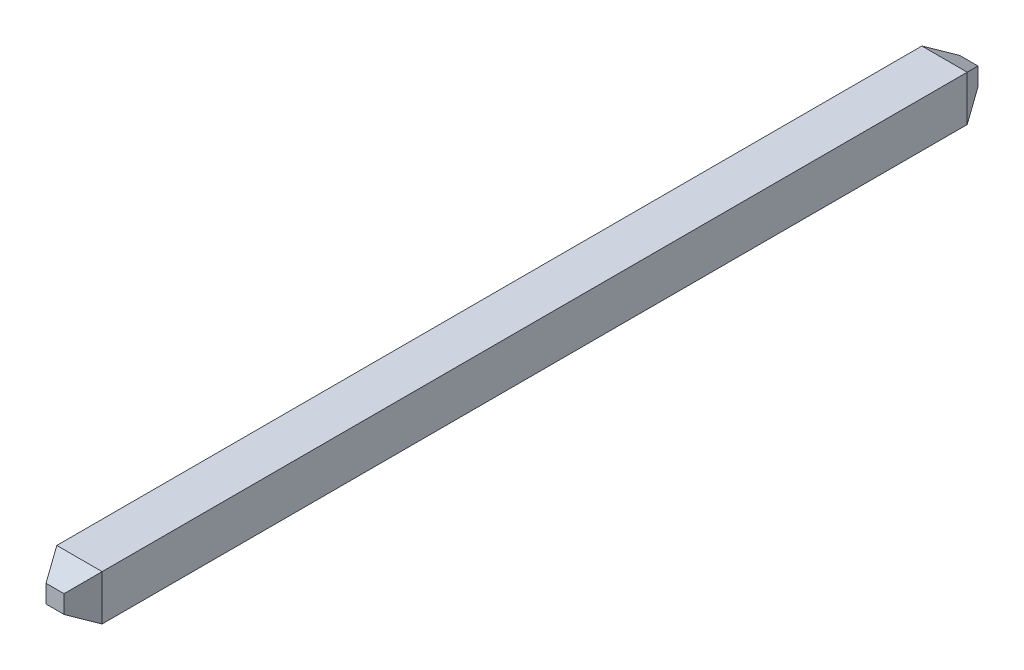
ISO-10303-21;
HEADER;
FILE_DESCRIPTION(('STEP AP214'),'2;1');
FILE_NAME('part.step','',(''),(''),'','','');
FILE_SCHEMA(('AUTOMOTIVE_DESIGN { 1 0 10303 214 1 1 1 1 }'));
ENDSEC;
DATA;
#1=APPLICATION_CONTEXT('core data for automotive mechanical design processes');
#2=APPLICATION_PROTOCOL_DEFINITION('international standard','automotive_design',2000,#1);
#3=PRODUCT_CONTEXT('',#1,'mechanical');
#4=PRODUCT('Part','Part','',(#3));
#5=PRODUCT_RELATED_PRODUCT_CATEGORY('part','',(#4));
#6=PRODUCT_DEFINITION_FORMATION('','',#4);
#7=PRODUCT_DEFINITION_CONTEXT('part definition',#1,'design');
#8=PRODUCT_DEFINITION('design','',#6,#7);
#9=PRODUCT_DEFINITION_SHAPE('','',#8);
#10=(LENGTH_UNIT() NAMED_UNIT(*) SI_UNIT(.MILLI.,.METRE.));
#11=(NAMED_UNIT(*) PLANE_ANGLE_UNIT() SI_UNIT($,.RADIAN.));
#12=(NAMED_UNIT(*) SI_UNIT($,.STERADIAN.) SOLID_ANGLE_UNIT());
#13=UNCERTAINTY_MEASURE_WITH_UNIT(LENGTH_MEASURE(1.E-05),#10,'distance_accuracy_value','');
#14=(GEOMETRIC_REPRESENTATION_CONTEXT(3) GLOBAL_UNCERTAINTY_ASSIGNED_CONTEXT((#13)) GLOBAL_UNIT_ASSIGNED_CONTEXT((#10,
#11,#12)) REPRESENTATION_CONTEXT('',''));
#15=CARTESIAN_POINT('',(0.,0.,0.));
#16=DIRECTION('',(0.,0.,1.));
#17=DIRECTION('',(1.,0.,0.));
#18=AXIS2_PLACEMENT_3D('',#15,#16,#17);
#19=CARTESIAN_POINT('',(2.66011510041924,0.945,-3.20872569516347));
#20=DIRECTION('',(0.872569516347454,0.,-0.488489958076081));
#21=DIRECTION('',(-0.488489958076081,0.,-0.872569516347454));
#22=AXIS2_PLACEMENT_3D('',#19,#20,#21);
#23=PLANE('',#22);
#24=DIRECTION('',(0.,1.,0.));
#25=VECTOR('',#24,1.);
#26=CARTESIAN_POINT('',(2.85534185664468,0.944999999999999,-2.86000017186176));
#27=LINE('',#26,#25);
#28=CARTESIAN_POINT('',(2.85534185663262,0.954999975315067,-2.85999984563027));
#29=VERTEX_POINT('',#28);
#30=CARTESIAN_POINT('',(2.85534201729186,1.58500016035866,-2.8599998849043));
#31=VERTEX_POINT('',#30);
#32=EDGE_CURVE('E118',#29,#31,#27,.T.);
#33=ORIENTED_EDGE('',*,*,#32,.F.);
#34=DIRECTION('',(0.439072617568647,-0.438284036988111,0.784297353956279));
#35=VECTOR('',#34,1.);
#36=CARTESIAN_POINT('',(2.665,1.145,-3.2));
#37=LINE('',#36,#35);
#38=CARTESIAN_POINT('',(2.665,1.145,-3.2));
#39=VERTEX_POINT('',#38);
#40=EDGE_CURVE('E116',#39,#29,#37,.T.);
#41=ORIENTED_EDGE('',*,*,#40,.F.);
#42=DIRECTION('',(0.,1.,0.));
#43=VECTOR('',#42,1.);
#44=CARTESIAN_POINT('',(2.665,1.135,-3.2));
#45=LINE('',#44,#43);
#46=CARTESIAN_POINT('',(2.665,1.395,-3.2));
#47=VERTEX_POINT('',#46);
#48=EDGE_CURVE('E79',#47,#39,#45,.F.);
#49=ORIENTED_EDGE('',*,*,#48,.F.);
#50=DIRECTION('',(-0.439072617568647,-0.438284036988111,-0.784297353956279));
#51=VECTOR('',#50,1.);
#52=CARTESIAN_POINT('',(2.85534185664468,1.585,-2.86000017186176));
#53=LINE('',#52,#51);
#54=EDGE_CURVE('E110',#31,#47,#53,.T.);
#55=ORIENTED_EDGE('',*,*,#54,.F.);
#56=EDGE_LOOP('',(#33,#41,#49,#55));
#57=FACE_BOUND('',#56,.T.);
#58=ADVANCED_FACE('F17',(#57),#23,.T.);
#59=CARTESIAN_POINT('',(2.66036702814295,0.945,9.50441734607014));
#60=DIRECTION('',(0.873317045523297,0.,0.487152273933376));
#61=DIRECTION('',(0.487152273933376,0.,-0.873317045523297));
#62=AXIS2_PLACEMENT_3D('',#59,#60,#61);
#63=PLANE('',#62);
#64=DIRECTION('',(-0.437799852400894,0.438586917260846,0.784839349959839));
#65=VECTOR('',#64,1.);
#66=CARTESIAN_POINT('',(2.85489789955164,0.954999686828527,9.15568378706484));
#67=LINE('',#66,#65);
#68=CARTESIAN_POINT('',(2.85489765454992,0.954999891076848,9.15568368845103));
#69=VERTEX_POINT('',#68);
#70=CARTESIAN_POINT('',(2.66523855088228,1.145,9.49568417561491));
#71=VERTEX_POINT('',#70);
#72=EDGE_CURVE('E122',#69,#71,#67,.T.);
#73=ORIENTED_EDGE('',*,*,#72,.F.);
#74=DIRECTION('',(0.,1.,0.));
#75=VECTOR('',#74,1.);
#76=CARTESIAN_POINT('',(2.85489853900642,0.944999999999999,9.155683722437));
#77=LINE('',#76,#75);
#78=CARTESIAN_POINT('',(2.85489765280461,1.5850001770326,9.15568371270386));
#79=VERTEX_POINT('',#78);
#80=EDGE_CURVE('E89',#79,#69,#77,.F.);
#81=ORIENTED_EDGE('',*,*,#80,.F.);
#82=DIRECTION('',(0.437799852400903,0.438586917260844,-0.784839349959835));
#83=VECTOR('',#82,1.);
#84=CARTESIAN_POINT('',(2.66523855088228,1.395,9.49568417561491));
#85=LINE('',#84,#83);
#86=CARTESIAN_POINT('',(2.66523855088228,1.395,9.49568417561491));
#87=VERTEX_POINT('',#86);
#88=EDGE_CURVE('E84',#87,#79,#85,.T.);
#89=ORIENTED_EDGE('',*,*,#88,.F.);
#90=DIRECTION('',(0.,1.,0.));
#91=VECTOR('',#90,1.);
#92=CARTESIAN_POINT('',(2.66523855088228,1.405,9.49568417561491));
#93=LINE('',#92,#91);
#94=EDGE_CURVE('E20',#71,#87,#93,.T.);
#95=ORIENTED_EDGE('',*,*,#94,.F.);
#96=EDGE_LOOP('',(#73,#81,#89,#95));
#97=FACE_BOUND('',#96,.T.);
#98=ADVANCED_FACE('F86',(#97),#63,.T.);
#99=CARTESIAN_POINT('',(2.40523855088228,1.405,9.49568417561491));
#100=DIRECTION('',(0.,0.,1.));
#101=DIRECTION('',(1.,0.,0.));
#102=AXIS2_PLACEMENT_3D('',#99,#100,#101);
#103=PLANE('',#102);
#104=DIRECTION('',(1.,0.,0.));
#105=VECTOR('',#104,1.);
#106=CARTESIAN_POINT('',(2.2148966942376,1.395,9.49568417561491));
#107=LINE('',#106,#105);
#108=CARTESIAN_POINT('',(2.41523855088228,1.395,9.49568417561491));
#109=VERTEX_POINT('',#108);
#110=EDGE_CURVE('E93',#109,#87,#107,.T.);
#111=ORIENTED_EDGE('',*,*,#110,.F.);
#112=DIRECTION('',(0.,1.,0.));
#113=VECTOR('',#112,1.);
#114=CARTESIAN_POINT('',(2.41523855088228,0.945,9.49568417561491));
#115=LINE('',#114,#113);
#116=CARTESIAN_POINT('',(2.41523855088228,1.145,9.49568417561491));
#117=VERTEX_POINT('',#116);
#118=EDGE_CURVE('E129',#117,#109,#115,.T.);
#119=ORIENTED_EDGE('',*,*,#118,.F.);
#120=DIRECTION('',(1.,0.,0.));
#121=VECTOR('',#120,1.);
#122=CARTESIAN_POINT('',(2.2148966942376,1.145,9.49568417561491));
#123=LINE('',#122,#121);
#124=EDGE_CURVE('E98',#71,#117,#123,.F.);
#125=ORIENTED_EDGE('',*,*,#124,.F.);
#126=ORIENTED_EDGE('',*,*,#94,.T.);
#127=EDGE_LOOP('',(#111,#119,#125,#126));
#128=FACE_BOUND('',#127,.T.);
#129=ADVANCED_FACE('F95',(#128),#103,.T.);
#130=CARTESIAN_POINT('',(2.2148966942376,1.39012178454432,9.50441360938624));
#131=DIRECTION('',(0.,0.872943377132664,0.487821545567864));
#132=DIRECTION('',(0.,-0.487821545567864,0.872943377132664));
#133=AXIS2_PLACEMENT_3D('',#130,#131,#132);
#134=PLANE('',#133);
#135=DIRECTION('',(-0.439072459537935,0.438284700441641,-0.78429707167252));
#136=VECTOR('',#135,1.);
#137=CARTESIAN_POINT('',(2.41523855088228,1.395,9.49568417561491));
#138=LINE('',#137,#136);
#139=CARTESIAN_POINT('',(2.2248975037028,1.58500008247257,9.15568447138297));
#140=VERTEX_POINT('',#139);
#141=EDGE_CURVE('E102',#109,#140,#138,.T.);
#142=ORIENTED_EDGE('',*,*,#141,.F.);
#143=ORIENTED_EDGE('',*,*,#110,.T.);
#144=ORIENTED_EDGE('',*,*,#88,.T.);
#145=DIRECTION('',(1.,0.,0.));
#146=VECTOR('',#145,1.);
#147=CARTESIAN_POINT('',(2.54006658937282,1.585,9.15568497320463));
#148=LINE('',#147,#146);
#149=EDGE_CURVE('E131',#140,#79,#148,.T.);
#150=ORIENTED_EDGE('',*,*,#149,.F.);
#151=EDGE_LOOP('',(#142,#143,#144,#150));
#152=FACE_BOUND('',#151,.T.);
#153=ADVANCED_FACE('F100',(#152),#134,.T.);
#154=CARTESIAN_POINT('',(2.405,1.135,-3.2));
#155=DIRECTION('',(0.,0.,-1.));
#156=DIRECTION('',(-1.,0.,0.));
#157=AXIS2_PLACEMENT_3D('',#154,#155,#156);
#158=PLANE('',#157);
#159=ORIENTED_EDGE('',*,*,#48,.T.);
#160=DIRECTION('',(1.,0.,0.));
#161=VECTOR('',#160,1.);
#162=CARTESIAN_POINT('',(2.21534185664468,1.145,-3.2));
#163=LINE('',#162,#161);
#164=CARTESIAN_POINT('',(2.415,1.145,-3.2));
#165=VERTEX_POINT('',#164);
#166=EDGE_CURVE('E113',#165,#39,#163,.T.);
#167=ORIENTED_EDGE('',*,*,#166,.F.);
#168=DIRECTION('',(0.,1.,0.));
#169=VECTOR('',#168,1.);
#170=CARTESIAN_POINT('',(2.415,0.945,-3.2));
#171=LINE('',#170,#169);
#172=CARTESIAN_POINT('',(2.415,1.395,-3.2));
#173=VERTEX_POINT('',#172);
#174=EDGE_CURVE('E140',#173,#165,#171,.F.);
#175=ORIENTED_EDGE('',*,*,#174,.F.);
#176=DIRECTION('',(1.,0.,0.));
#177=VECTOR('',#176,1.);
#178=CARTESIAN_POINT('',(2.21534185664468,1.395,-3.2));
#179=LINE('',#178,#177);
#180=EDGE_CURVE('E105',#47,#173,#179,.F.);
#181=ORIENTED_EDGE('',*,*,#180,.F.);
#182=EDGE_LOOP('',(#159,#167,#175,#181));
#183=FACE_BOUND('',#182,.T.);
#184=ADVANCED_FACE('F184',(#183),#158,.T.);
#185=CARTESIAN_POINT('',(2.21534185664468,1.58987821545568,-2.85127073809043));
#186=DIRECTION('',(0.,0.872943377132663,-0.487821545567865));
#187=DIRECTION('',(0.,0.487821545567865,0.872943377132663));
#188=AXIS2_PLACEMENT_3D('',#185,#186,#187);
#189=PLANE('',#188);
#190=DIRECTION('',(1.,0.,0.));
#191=VECTOR('',#190,1.);
#192=CARTESIAN_POINT('',(2.54006658937282,1.585,-2.86000017186176));
#193=LINE('',#192,#191);
#194=CARTESIAN_POINT('',(2.22534144768619,1.5850007068091,-2.8599984305592));
#195=VERTEX_POINT('',#194);
#196=EDGE_CURVE('E137',#31,#195,#193,.F.);
#197=ORIENTED_EDGE('',*,*,#196,.F.);
#198=ORIENTED_EDGE('',*,*,#54,.T.);
#199=ORIENTED_EDGE('',*,*,#180,.T.);
#200=DIRECTION('',(0.437798396819592,-0.43858642908966,-0.784840434713054));
#201=VECTOR('',#200,1.);
#202=CARTESIAN_POINT('',(2.22534066407532,1.58500072063078,-2.85999803394471));
#203=LINE('',#202,#201);
#204=EDGE_CURVE('E145',#195,#173,#203,.T.);
#205=ORIENTED_EDGE('',*,*,#204,.F.);
#206=EDGE_LOOP('',(#197,#198,#199,#205));
#207=FACE_BOUND('',#206,.T.);
#208=ADVANCED_FACE('F182',(#207),#189,.T.);
#209=CARTESIAN_POINT('',(2.21534185664468,1.14987821545568,-3.20872943377133));
#210=DIRECTION('',(0.,-0.872943377132663,-0.487821545567865));
#211=DIRECTION('',(0.,0.487821545567865,-0.872943377132663));
#212=AXIS2_PLACEMENT_3D('',#209,#210,#211);
#213=PLANE('',#212);
#214=ORIENTED_EDGE('',*,*,#166,.T.);
#215=ORIENTED_EDGE('',*,*,#40,.T.);
#216=DIRECTION('',(1.,0.,0.));
#217=VECTOR('',#216,1.);
#218=CARTESIAN_POINT('',(2.21494834685547,0.955,-2.85999756200982));
#219=LINE('',#218,#217);
#220=CARTESIAN_POINT('',(2.22534198218488,0.954999729763457,-2.85999898491791));
#221=VERTEX_POINT('',#220);
#222=EDGE_CURVE('E35',#221,#29,#219,.T.);
#223=ORIENTED_EDGE('',*,*,#222,.F.);
#224=DIRECTION('',(-0.437798396819591,-0.438586429089664,0.784840434713052));
#225=VECTOR('',#224,1.);
#226=CARTESIAN_POINT('',(2.415,1.145,-3.2));
#227=LINE('',#226,#225);
#228=EDGE_CURVE('E143',#165,#221,#227,.T.);
#229=ORIENTED_EDGE('',*,*,#228,.F.);
#230=EDGE_LOOP('',(#214,#215,#223,#229));
#231=FACE_BOUND('',#230,.T.);
#232=ADVANCED_FACE('F185',(#231),#213,.T.);
#233=CARTESIAN_POINT('',(2.85534630826875,0.944999999999999,-2.98065701705514));
#234=DIRECTION('',(0.999999999319383,0.,3.68949151671631E-05));
#235=DIRECTION('',(3.68949151671631E-05,0.,-0.999999999319383));
#236=AXIS2_PLACEMENT_3D('',#233,#234,#235);
#237=PLANE('',#236);
#238=DIRECTION('',(3.69481335097372E-05,0.,-0.999999999317418));
#239=VECTOR('',#238,1.);
#240=CARTESIAN_POINT('',(2.85489789955164,1.585,9.1556837224134));
#241=LINE('',#240,#239);
#242=EDGE_CURVE('E134',#79,#31,#241,.T.);
#243=ORIENTED_EDGE('',*,*,#242,.F.);
#244=ORIENTED_EDGE('',*,*,#80,.T.);
#245=DIRECTION('',(-3.69481335097373E-05,0.,0.999999999317418));
#246=VECTOR('',#245,1.);
#247=CARTESIAN_POINT('',(2.85534185664468,0.955,-2.86000017186176));
#248=LINE('',#247,#246);
#249=EDGE_CURVE('E149',#29,#69,#248,.T.);
#250=ORIENTED_EDGE('',*,*,#249,.F.);
#251=ORIENTED_EDGE('',*,*,#32,.T.);
#252=EDGE_LOOP('',(#243,#244,#250,#251));
#253=FACE_BOUND('',#252,.T.);
#254=ADVANCED_FACE('F187',(#253),#237,.T.);
#255=CARTESIAN_POINT('',(2.2148966942376,0.950121784544321,9.14695491370534));
#256=DIRECTION('',(0.,-0.872943377132664,0.487821545567865));
#257=DIRECTION('',(0.,-0.487821545567865,-0.872943377132664));
#258=AXIS2_PLACEMENT_3D('',#255,#256,#257);
#259=PLANE('',#258);
#260=ORIENTED_EDGE('',*,*,#124,.T.);
#261=DIRECTION('',(0.439072459537931,0.438284700441657,0.784297071672513));
#262=VECTOR('',#261,1.);
#263=CARTESIAN_POINT('',(2.22489724886554,0.955000197635095,9.15568533818575));
#264=LINE('',#263,#262);
#265=CARTESIAN_POINT('',(2.22489781760237,0.955000116075707,9.15568487573228));
#266=VERTEX_POINT('',#265);
#267=EDGE_CURVE('E126',#266,#117,#264,.T.);
#268=ORIENTED_EDGE('',*,*,#267,.F.);
#269=DIRECTION('',(1.,0.,0.));
#270=VECTOR('',#269,1.);
#271=CARTESIAN_POINT('',(2.21494834685547,0.955,9.15568372241339));
#272=LINE('',#271,#270);
#273=EDGE_CURVE('E152',#69,#266,#272,.F.);
#274=ORIENTED_EDGE('',*,*,#273,.F.);
#275=ORIENTED_EDGE('',*,*,#72,.T.);
#276=EDGE_LOOP('',(#260,#268,#274,#275));
#277=FACE_BOUND('',#276,.T.);
#278=ADVANCED_FACE('F174',(#277),#259,.T.);
#279=CARTESIAN_POINT('',(2.42012345046304,0.945,9.50440987077839));
#280=DIRECTION('',(-0.872569516347453,0.,0.488489958076081));
#281=DIRECTION('',(0.488489958076081,0.,0.872569516347453));
#282=AXIS2_PLACEMENT_3D('',#279,#280,#281);
#283=PLANE('',#282);
#284=ORIENTED_EDGE('',*,*,#267,.T.);
#285=ORIENTED_EDGE('',*,*,#118,.T.);
#286=ORIENTED_EDGE('',*,*,#141,.T.);
#287=DIRECTION('',(0.,1.,0.));
#288=VECTOR('',#287,1.);
#289=CARTESIAN_POINT('',(2.22489853896028,0.945,9.15568497322818));
#290=LINE('',#289,#288);
#291=EDGE_CURVE('E155',#266,#140,#290,.T.);
#292=ORIENTED_EDGE('',*,*,#291,.F.);
#293=EDGE_LOOP('',(#284,#285,#286,#292));
#294=FACE_BOUND('',#293,.T.);
#295=ADVANCED_FACE('F177',(#294),#283,.T.);
#296=CARTESIAN_POINT('',(2.54006658937282,1.585,9.32634470275115));
#297=DIRECTION('',(0.,1.,0.));
#298=DIRECTION('',(0.,0.,1.));
#299=AXIS2_PLACEMENT_3D('',#296,#297,#298);
#300=PLANE('',#299);
#301=ORIENTED_EDGE('',*,*,#196,.T.);
#302=DIRECTION('',(-3.68949151674615E-05,0.,0.999999999319383));
#303=VECTOR('',#302,1.);
#304=CARTESIAN_POINT('',(2.22489224235438,1.5849998023649,9.32634821671993));
#305=LINE('',#304,#303);
#306=EDGE_CURVE('E158',#140,#195,#305,.F.);
#307=ORIENTED_EDGE('',*,*,#306,.F.);
#308=ORIENTED_EDGE('',*,*,#149,.T.);
#309=ORIENTED_EDGE('',*,*,#242,.T.);
#310=EDGE_LOOP('',(#301,#307,#308,#309));
#311=FACE_BOUND('',#310,.T.);
#312=ADVANCED_FACE('F179',(#311),#300,.T.);
#313=CARTESIAN_POINT('',(2.41987152273933,0.945,-3.20873317045523));
#314=DIRECTION('',(-0.873317045523298,0.,-0.487152273933376));
#315=DIRECTION('',(-0.487152273933376,0.,0.873317045523298));
#316=AXIS2_PLACEMENT_3D('',#313,#314,#315);
#317=PLANE('',#316);
#318=DIRECTION('',(0.,1.,0.));
#319=VECTOR('',#318,1.);
#320=CARTESIAN_POINT('',(2.22534185654839,0.945,-2.85999756199704));
#321=LINE('',#320,#319);
#322=EDGE_CURVE('E26',#195,#221,#321,.F.);
#323=ORIENTED_EDGE('',*,*,#322,.F.);
#324=ORIENTED_EDGE('',*,*,#204,.T.);
#325=ORIENTED_EDGE('',*,*,#174,.T.);
#326=ORIENTED_EDGE('',*,*,#228,.T.);
#327=EDGE_LOOP('',(#323,#324,#325,#326));
#328=FACE_BOUND('',#327,.T.);
#329=ADVANCED_FACE('F168',(#328),#317,.T.);
#330=CARTESIAN_POINT('',(2.21494834685547,0.955,3.17284922525592));
#331=DIRECTION('',(0.,-1.,0.));
#332=DIRECTION('',(0.,0.,-1.));
#333=AXIS2_PLACEMENT_3D('',#330,#331,#332);
#334=PLANE('',#333);
#335=ORIENTED_EDGE('',*,*,#249,.T.);
#336=ORIENTED_EDGE('',*,*,#273,.T.);
#337=DIRECTION('',(-3.68949151674615E-05,0.,0.999999999319383));
#338=VECTOR('',#337,1.);
#339=CARTESIAN_POINT('',(2.22489224235438,0.954999279369218,9.32634821671993));
#340=LINE('',#339,#338);
#341=EDGE_CURVE('E11',#221,#266,#340,.T.);
#342=ORIENTED_EDGE('',*,*,#341,.F.);
#343=ORIENTED_EDGE('',*,*,#222,.T.);
#344=EDGE_LOOP('',(#335,#336,#342,#343));
#345=FACE_BOUND('',#344,.T.);
#346=ADVANCED_FACE('F170',(#345),#334,.T.);
#347=CARTESIAN_POINT('',(2.22489224235438,0.945,9.32634821671993));
#348=DIRECTION('',(-0.999999999319383,0.,-3.68949151674615E-05));
#349=DIRECTION('',(-3.68949151674615E-05,0.,0.999999999319383));
#350=AXIS2_PLACEMENT_3D('',#347,#348,#349);
#351=PLANE('',#350);
#352=ORIENTED_EDGE('',*,*,#322,.T.);
#353=ORIENTED_EDGE('',*,*,#341,.T.);
#354=ORIENTED_EDGE('',*,*,#291,.T.);
#355=ORIENTED_EDGE('',*,*,#306,.T.);
#356=EDGE_LOOP('',(#352,#353,#354,#355));
#357=FACE_BOUND('',#356,.T.);
#358=ADVANCED_FACE('F164',(#357),#351,.T.);
#359=CLOSED_SHELL('',(#58,#98,#129,#153,#184,#208,#232,#254,#278,#295,#312,#329,#346,#358));
#360=MANIFOLD_SOLID_BREP('B1',#359);
#361=ADVANCED_BREP_SHAPE_REPRESENTATION('',(#18,#360),#14);
#362=SHAPE_DEFINITION_REPRESENTATION(#9,#361);
ENDSEC;
END-ISO-10303-21;
